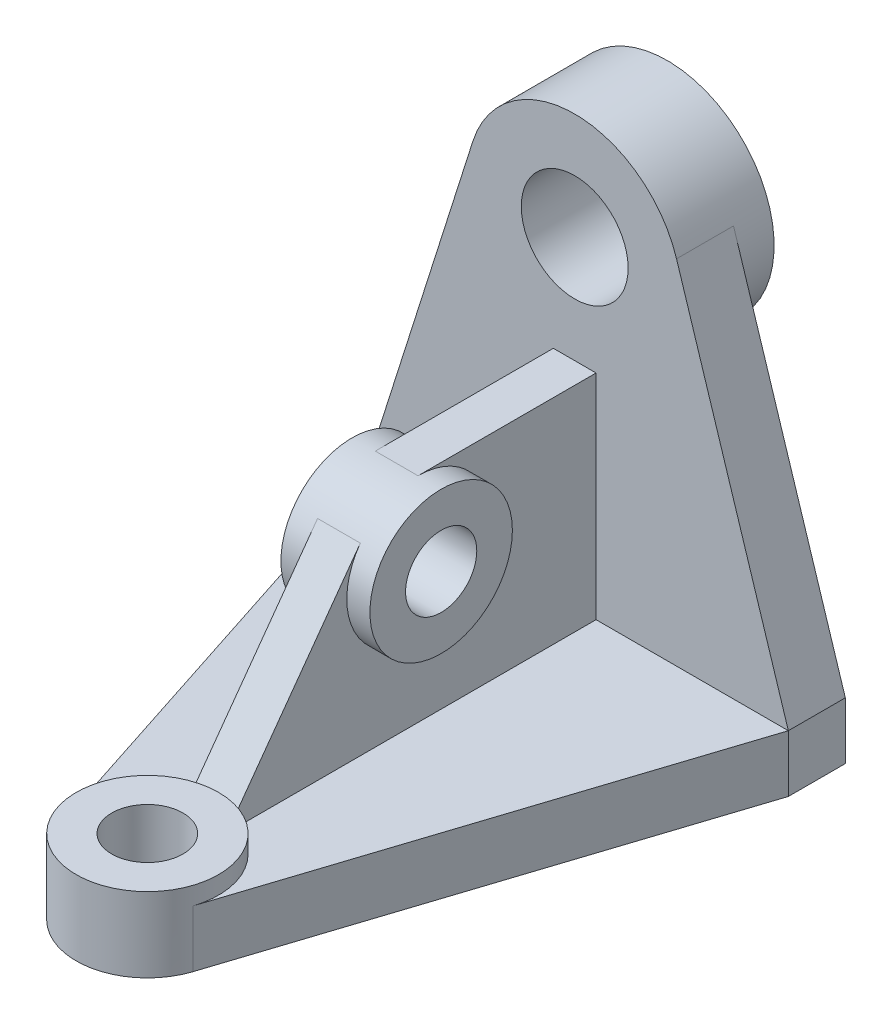
ISO-10303-21;
HEADER;
FILE_DESCRIPTION(('STEP AP214'),'2;1');
FILE_NAME('part.step','',(''),(''),'','','');
FILE_SCHEMA(('AUTOMOTIVE_DESIGN { 1 0 10303 214 1 1 1 1 }'));
ENDSEC;
DATA;
#1=APPLICATION_CONTEXT('core data for automotive mechanical design processes');
#2=APPLICATION_PROTOCOL_DEFINITION('international standard','automotive_design',2000,#1);
#3=PRODUCT_CONTEXT('',#1,'mechanical');
#4=PRODUCT('Part','Part','',(#3));
#5=PRODUCT_RELATED_PRODUCT_CATEGORY('part','',(#4));
#6=PRODUCT_DEFINITION_FORMATION('','',#4);
#7=PRODUCT_DEFINITION_CONTEXT('part definition',#1,'design');
#8=PRODUCT_DEFINITION('design','',#6,#7);
#9=PRODUCT_DEFINITION_SHAPE('','',#8);
#10=(LENGTH_UNIT() NAMED_UNIT(*) SI_UNIT(.MILLI.,.METRE.));
#11=(NAMED_UNIT(*) PLANE_ANGLE_UNIT() SI_UNIT($,.RADIAN.));
#12=(NAMED_UNIT(*) SI_UNIT($,.STERADIAN.) SOLID_ANGLE_UNIT());
#13=UNCERTAINTY_MEASURE_WITH_UNIT(LENGTH_MEASURE(1.E-05),#10,'distance_accuracy_value','');
#14=(GEOMETRIC_REPRESENTATION_CONTEXT(3) GLOBAL_UNCERTAINTY_ASSIGNED_CONTEXT((#13)) GLOBAL_UNIT_ASSIGNED_CONTEXT((#10,
#11,#12)) REPRESENTATION_CONTEXT('',''));
#15=CARTESIAN_POINT('',(0.,0.,0.));
#16=DIRECTION('',(0.,0.,1.));
#17=DIRECTION('',(1.,0.,0.));
#18=AXIS2_PLACEMENT_3D('',#15,#16,#17);
#19=CARTESIAN_POINT('',(0.,16.,136.));
#20=DIRECTION('',(0.,-1.,0.));
#21=DIRECTION('',(0.,0.,-1.));
#22=AXIS2_PLACEMENT_3D('',#19,#20,#21);
#23=PLANE('',#22);
#24=DIRECTION('',(0.,0.,1.));
#25=VECTOR('',#24,1.);
#26=CARTESIAN_POINT('',(-6.,16.,136.));
#27=LINE('',#26,#25);
#28=CARTESIAN_POINT('',(-6.,16.,16.));
#29=VERTEX_POINT('',#28);
#30=CARTESIAN_POINT('',(-6.,16.,116.921215971661));
#31=VERTEX_POINT('',#30);
#32=EDGE_CURVE('E51',#29,#31,#27,.T.);
#33=ORIENTED_EDGE('',*,*,#32,.F.);
#34=DIRECTION('',(1.,0.,0.));
#35=VECTOR('',#34,1.);
#36=CARTESIAN_POINT('',(-60.,16.,16.));
#37=LINE('',#36,#35);
#38=CARTESIAN_POINT('',(-60.,16.,16.));
#39=VERTEX_POINT('',#38);
#40=EDGE_CURVE('E227',#39,#29,#37,.T.);
#41=ORIENTED_EDGE('',*,*,#40,.F.);
#42=DIRECTION('',(-0.30888330538072,0.,-0.951099944094773));
#43=VECTOR('',#42,1.);
#44=CARTESIAN_POINT('',(-19.0219988818955,16.,142.177666107614));
#45=LINE('',#44,#43);
#46=CARTESIAN_POINT('',(-19.0219988818955,16.,142.177666107614));
#47=VERTEX_POINT('',#46);
#48=EDGE_CURVE('E223',#47,#39,#45,.T.);
#49=ORIENTED_EDGE('',*,*,#48,.F.);
#50=CARTESIAN_POINT('',(0.,16.,136.));
#51=DIRECTION('',(0.,1.,0.));
#52=DIRECTION('',(0.,0.,1.));
#53=AXIS2_PLACEMENT_3D('',#50,#51,#52);
#54=CIRCLE('',#53,20.);
#55=EDGE_CURVE('E204',#31,#47,#54,.T.);
#56=ORIENTED_EDGE('',*,*,#55,.F.);
#57=EDGE_LOOP('',(#33,#41,#49,#56));
#58=FACE_BOUND('',#57,.T.);
#59=ADVANCED_FACE('F36',(#58),#23,.F.);
#60=CARTESIAN_POINT('',(6.,16.,16.));
#61=VERTEX_POINT('',#60);
#62=CARTESIAN_POINT('',(60.,16.,16.));
#63=VERTEX_POINT('',#62);
#64=EDGE_CURVE('E89',#61,#63,#37,.T.);
#65=ORIENTED_EDGE('',*,*,#64,.F.);
#66=DIRECTION('',(0.,0.,1.));
#67=VECTOR('',#66,1.);
#68=CARTESIAN_POINT('',(6.,16.,136.));
#69=LINE('',#68,#67);
#70=CARTESIAN_POINT('',(6.,16.,116.921215971661));
#71=VERTEX_POINT('',#70);
#72=EDGE_CURVE('E196',#61,#71,#69,.T.);
#73=ORIENTED_EDGE('',*,*,#72,.T.);
#74=CARTESIAN_POINT('',(19.0219988818955,16.,142.177666107614));
#75=VERTEX_POINT('',#74);
#76=EDGE_CURVE('E209',#75,#71,#54,.T.);
#77=ORIENTED_EDGE('',*,*,#76,.F.);
#78=DIRECTION('',(-0.30888330538072,0.,0.951099944094773));
#79=VECTOR('',#78,1.);
#80=CARTESIAN_POINT('',(60.,16.,16.));
#81=LINE('',#80,#79);
#82=EDGE_CURVE('E230',#63,#75,#81,.T.);
#83=ORIENTED_EDGE('',*,*,#82,.F.);
#84=EDGE_LOOP('',(#65,#73,#77,#83));
#85=FACE_BOUND('',#84,.T.);
#86=ADVANCED_FACE('F339',(#85),#23,.F.);
#87=CARTESIAN_POINT('',(0.,106.,16.));
#88=DIRECTION('',(0.,0.,1.));
#89=DIRECTION('',(1.,0.,0.));
#90=AXIS2_PLACEMENT_3D('',#87,#88,#89);
#91=PLANE('',#90);
#92=DIRECTION('',(0.,1.,0.));
#93=VECTOR('',#92,1.);
#94=CARTESIAN_POINT('',(6.,106.,16.));
#95=LINE('',#94,#93);
#96=CARTESIAN_POINT('',(6.,76.,16.));
#97=VERTEX_POINT('',#96);
#98=EDGE_CURVE('E199',#61,#97,#95,.T.);
#99=ORIENTED_EDGE('',*,*,#98,.F.);
#100=ORIENTED_EDGE('',*,*,#64,.T.);
#101=DIRECTION('',(-0.302169479251962,0.953254218877943,0.));
#102=VECTOR('',#101,1.);
#103=CARTESIAN_POINT('',(60.,16.,16.));
#104=LINE('',#103,#102);
#105=CARTESIAN_POINT('',(28.5976265663383,115.065084377559,16.));
#106=VERTEX_POINT('',#105);
#107=EDGE_CURVE('E251',#63,#106,#104,.T.);
#108=ORIENTED_EDGE('',*,*,#107,.T.);
#109=CARTESIAN_POINT('',(0.,106.,16.));
#110=DIRECTION('',(0.,0.,1.));
#111=DIRECTION('',(1.,0.,0.));
#112=AXIS2_PLACEMENT_3D('',#109,#110,#111);
#113=CIRCLE('',#112,30.);
#114=CARTESIAN_POINT('',(-28.5976265663383,115.065084377559,16.));
#115=VERTEX_POINT('',#114);
#116=EDGE_CURVE('E60',#106,#115,#113,.T.);
#117=ORIENTED_EDGE('',*,*,#116,.T.);
#118=DIRECTION('',(-0.302169479251962,-0.953254218877943,0.));
#119=VECTOR('',#118,1.);
#120=CARTESIAN_POINT('',(-60.,16.,16.));
#121=LINE('',#120,#119);
#122=EDGE_CURVE('E254',#115,#39,#121,.T.);
#123=ORIENTED_EDGE('',*,*,#122,.T.);
#124=ORIENTED_EDGE('',*,*,#40,.T.);
#125=DIRECTION('',(0.,1.,0.));
#126=VECTOR('',#125,1.);
#127=CARTESIAN_POINT('',(-6.,106.,16.));
#128=LINE('',#127,#126);
#129=CARTESIAN_POINT('',(-6.,76.,16.));
#130=VERTEX_POINT('',#129);
#131=EDGE_CURVE('E192',#29,#130,#128,.T.);
#132=ORIENTED_EDGE('',*,*,#131,.T.);
#133=DIRECTION('',(1.,0.,0.));
#134=VECTOR('',#133,1.);
#135=CARTESIAN_POINT('',(0.,76.,16.));
#136=LINE('',#135,#134);
#137=EDGE_CURVE('E181',#97,#130,#136,.F.);
#138=ORIENTED_EDGE('',*,*,#137,.F.);
#139=EDGE_LOOP('',(#99,#100,#108,#117,#123,#124,#132,#138));
#140=FACE_BOUND('',#139,.T.);
#141=CARTESIAN_POINT('',(0.,106.,16.));
#142=DIRECTION('',(0.,0.,1.));
#143=DIRECTION('',(1.,0.,0.));
#144=AXIS2_PLACEMENT_3D('',#141,#142,#143);
#145=CIRCLE('',#144,15.);
#146=CARTESIAN_POINT('',(15.,106.,16.));
#147=VERTEX_POINT('',#146);
#148=EDGE_CURVE('E243',#147,#147,#145,.T.);
#149=ORIENTED_EDGE('',*,*,#148,.F.);
#150=EDGE_LOOP('',(#149));
#151=FACE_BOUND('',#150,.T.);
#152=ADVANCED_FACE('F301',(#140,#151),#91,.T.);
#153=CARTESIAN_POINT('',(0.,106.,0.));
#154=DIRECTION('',(0.,0.,1.));
#155=DIRECTION('',(1.,0.,0.));
#156=AXIS2_PLACEMENT_3D('',#153,#154,#155);
#157=PLANE('',#156);
#158=DIRECTION('',(-0.302169479251962,-0.953254218877943,0.));
#159=VECTOR('',#158,1.);
#160=CARTESIAN_POINT('',(-60.,16.,0.));
#161=LINE('',#160,#159);
#162=CARTESIAN_POINT('',(-28.5976265663383,115.065084377559,0.));
#163=VERTEX_POINT('',#162);
#164=CARTESIAN_POINT('',(-60.,16.,0.));
#165=VERTEX_POINT('',#164);
#166=EDGE_CURVE('E264',#163,#165,#161,.T.);
#167=ORIENTED_EDGE('',*,*,#166,.F.);
#168=CARTESIAN_POINT('',(0.,106.,0.));
#169=DIRECTION('',(0.,0.,-1.));
#170=DIRECTION('',(-1.,0.,0.));
#171=AXIS2_PLACEMENT_3D('',#168,#169,#170);
#172=CIRCLE('',#171,30.);
#173=CARTESIAN_POINT('',(28.5976265663383,115.065084377559,0.));
#174=VERTEX_POINT('',#173);
#175=EDGE_CURVE('E44',#174,#163,#172,.T.);
#176=ORIENTED_EDGE('',*,*,#175,.F.);
#177=DIRECTION('',(-0.302169479251962,0.953254218877943,0.));
#178=VECTOR('',#177,1.);
#179=CARTESIAN_POINT('',(60.,16.,0.));
#180=LINE('',#179,#178);
#181=CARTESIAN_POINT('',(60.,16.,0.));
#182=VERTEX_POINT('',#181);
#183=EDGE_CURVE('E261',#182,#174,#180,.T.);
#184=ORIENTED_EDGE('',*,*,#183,.F.);
#185=DIRECTION('',(0.,1.,0.));
#186=VECTOR('',#185,1.);
#187=CARTESIAN_POINT('',(60.,0.,0.));
#188=LINE('',#187,#186);
#189=CARTESIAN_POINT('',(60.,0.,0.));
#190=VERTEX_POINT('',#189);
#191=EDGE_CURVE('E247',#190,#182,#188,.T.);
#192=ORIENTED_EDGE('',*,*,#191,.F.);
#193=DIRECTION('',(1.,0.,0.));
#194=VECTOR('',#193,1.);
#195=CARTESIAN_POINT('',(-60.,0.,0.));
#196=LINE('',#195,#194);
#197=CARTESIAN_POINT('',(-60.,0.,0.));
#198=VERTEX_POINT('',#197);
#199=EDGE_CURVE('E84',#198,#190,#196,.T.);
#200=ORIENTED_EDGE('',*,*,#199,.F.);
#201=DIRECTION('',(0.,-1.,0.));
#202=VECTOR('',#201,1.);
#203=CARTESIAN_POINT('',(-60.,0.,0.));
#204=LINE('',#203,#202);
#205=EDGE_CURVE('E266',#165,#198,#204,.T.);
#206=ORIENTED_EDGE('',*,*,#205,.F.);
#207=EDGE_LOOP('',(#167,#176,#184,#192,#200,#206));
#208=FACE_BOUND('',#207,.T.);
#209=ADVANCED_FACE('F291',(#208),#157,.F.);
#210=CARTESIAN_POINT('',(60.,0.,16.));
#211=DIRECTION('',(-1.,0.,0.));
#212=DIRECTION('',(0.,0.,1.));
#213=AXIS2_PLACEMENT_3D('',#210,#211,#212);
#214=PLANE('',#213);
#215=ORIENTED_EDGE('',*,*,#191,.T.);
#216=DIRECTION('',(0.,0.,-1.));
#217=VECTOR('',#216,1.);
#218=CARTESIAN_POINT('',(60.,16.,16.));
#219=LINE('',#218,#217);
#220=EDGE_CURVE('E219',#63,#182,#219,.T.);
#221=ORIENTED_EDGE('',*,*,#220,.F.);
#222=DIRECTION('',(0.,1.,0.));
#223=VECTOR('',#222,1.);
#224=CARTESIAN_POINT('',(60.,0.,16.));
#225=LINE('',#224,#223);
#226=CARTESIAN_POINT('',(60.,0.,16.));
#227=VERTEX_POINT('',#226);
#228=EDGE_CURVE('E248',#227,#63,#225,.T.);
#229=ORIENTED_EDGE('',*,*,#228,.F.);
#230=DIRECTION('',(0.,0.,-1.));
#231=VECTOR('',#230,1.);
#232=CARTESIAN_POINT('',(60.,0.,16.));
#233=LINE('',#232,#231);
#234=EDGE_CURVE('E258',#227,#190,#233,.T.);
#235=ORIENTED_EDGE('',*,*,#234,.T.);
#236=EDGE_LOOP('',(#215,#221,#229,#235));
#237=FACE_BOUND('',#236,.T.);
#238=ADVANCED_FACE('F38',(#237),#214,.F.);
#239=CARTESIAN_POINT('',(60.,16.,16.));
#240=DIRECTION('',(-0.953254218877943,-0.302169479251962,0.));
#241=DIRECTION('',(0.302169479251962,-0.953254218877944,0.));
#242=AXIS2_PLACEMENT_3D('',#239,#240,#241);
#243=PLANE('',#242);
#244=ORIENTED_EDGE('',*,*,#183,.T.);
#245=DIRECTION('',(0.,0.,-1.));
#246=VECTOR('',#245,1.);
#247=CARTESIAN_POINT('',(28.5976265663383,115.065084377559,16.));
#248=LINE('',#247,#246);
#249=EDGE_CURVE('E278',#106,#174,#248,.T.);
#250=ORIENTED_EDGE('',*,*,#249,.F.);
#251=ORIENTED_EDGE('',*,*,#107,.F.);
#252=ORIENTED_EDGE('',*,*,#220,.T.);
#253=EDGE_LOOP('',(#244,#250,#251,#252));
#254=FACE_BOUND('',#253,.T.);
#255=ADVANCED_FACE('F284',(#254),#243,.F.);
#256=CARTESIAN_POINT('',(0.,106.,16.));
#257=DIRECTION('',(0.,0.,-1.));
#258=DIRECTION('',(-1.,0.,0.));
#259=AXIS2_PLACEMENT_3D('',#256,#257,#258);
#260=CYLINDRICAL_SURFACE('',#259,30.);
#261=ORIENTED_EDGE('',*,*,#175,.T.);
#262=DIRECTION('',(0.,0.,-1.));
#263=VECTOR('',#262,1.);
#264=CARTESIAN_POINT('',(-28.5976265663383,115.065084377559,16.));
#265=LINE('',#264,#263);
#266=EDGE_CURVE('E275',#115,#163,#265,.T.);
#267=ORIENTED_EDGE('',*,*,#266,.F.);
#268=ORIENTED_EDGE('',*,*,#116,.F.);
#269=ORIENTED_EDGE('',*,*,#249,.T.);
#270=EDGE_LOOP('',(#261,#267,#268,#269));
#271=FACE_BOUND('',#270,.T.);
#272=CARTESIAN_POINT('',(0.,106.,-10.));
#273=DIRECTION('',(0.,0.,-1.));
#274=DIRECTION('',(-1.,0.,0.));
#275=AXIS2_PLACEMENT_3D('',#272,#273,#274);
#276=CIRCLE('',#275,30.);
#277=CARTESIAN_POINT('',(-30.,106.,-10.));
#278=VERTEX_POINT('',#277);
#279=EDGE_CURVE('E214',#278,#278,#276,.T.);
#280=ORIENTED_EDGE('',*,*,#279,.F.);
#281=EDGE_LOOP('',(#280));
#282=FACE_BOUND('',#281,.T.);
#283=ADVANCED_FACE('F294',(#271,#282),#260,.T.);
#284=CARTESIAN_POINT('',(-60.,16.,16.));
#285=DIRECTION('',(0.953254218877943,-0.302169479251962,0.));
#286=DIRECTION('',(0.302169479251962,0.953254218877943,0.));
#287=AXIS2_PLACEMENT_3D('',#284,#285,#286);
#288=PLANE('',#287);
#289=ORIENTED_EDGE('',*,*,#166,.T.);
#290=DIRECTION('',(0.,0.,-1.));
#291=VECTOR('',#290,1.);
#292=CARTESIAN_POINT('',(-60.,16.,16.));
#293=LINE('',#292,#291);
#294=EDGE_CURVE('E272',#39,#165,#293,.T.);
#295=ORIENTED_EDGE('',*,*,#294,.F.);
#296=ORIENTED_EDGE('',*,*,#122,.F.);
#297=ORIENTED_EDGE('',*,*,#266,.T.);
#298=EDGE_LOOP('',(#289,#295,#296,#297));
#299=FACE_BOUND('',#298,.T.);
#300=ADVANCED_FACE('F299',(#299),#288,.F.);
#301=CARTESIAN_POINT('',(-60.,0.,16.));
#302=DIRECTION('',(1.,0.,0.));
#303=DIRECTION('',(0.,0.,-1.));
#304=AXIS2_PLACEMENT_3D('',#301,#302,#303);
#305=PLANE('',#304);
#306=ORIENTED_EDGE('',*,*,#205,.T.);
#307=DIRECTION('',(0.,0.,-1.));
#308=VECTOR('',#307,1.);
#309=CARTESIAN_POINT('',(-60.,0.,16.));
#310=LINE('',#309,#308);
#311=CARTESIAN_POINT('',(-60.,0.,16.));
#312=VERTEX_POINT('',#311);
#313=EDGE_CURVE('E270',#312,#198,#310,.T.);
#314=ORIENTED_EDGE('',*,*,#313,.F.);
#315=DIRECTION('',(0.,-1.,0.));
#316=VECTOR('',#315,1.);
#317=CARTESIAN_POINT('',(-60.,0.,16.));
#318=LINE('',#317,#316);
#319=EDGE_CURVE('E256',#39,#312,#318,.T.);
#320=ORIENTED_EDGE('',*,*,#319,.F.);
#321=ORIENTED_EDGE('',*,*,#294,.T.);
#322=EDGE_LOOP('',(#306,#314,#320,#321));
#323=FACE_BOUND('',#322,.T.);
#324=ADVANCED_FACE('F361',(#323),#305,.F.);
#325=CARTESIAN_POINT('',(-60.,0.,16.));
#326=DIRECTION('',(0.,1.,0.));
#327=DIRECTION('',(0.,0.,1.));
#328=AXIS2_PLACEMENT_3D('',#325,#326,#327);
#329=PLANE('',#328);
#330=ORIENTED_EDGE('',*,*,#199,.T.);
#331=ORIENTED_EDGE('',*,*,#234,.F.);
#332=DIRECTION('',(-0.30888330538072,0.,0.951099944094773));
#333=VECTOR('',#332,1.);
#334=CARTESIAN_POINT('',(60.,0.,16.));
#335=LINE('',#334,#333);
#336=CARTESIAN_POINT('',(19.0219988818955,0.,142.177666107614));
#337=VERTEX_POINT('',#336);
#338=EDGE_CURVE('E226',#227,#337,#335,.T.);
#339=ORIENTED_EDGE('',*,*,#338,.T.);
#340=CARTESIAN_POINT('',(0.,0.,136.));
#341=DIRECTION('',(0.,-1.,0.));
#342=DIRECTION('',(0.,0.,-1.));
#343=AXIS2_PLACEMENT_3D('',#340,#341,#342);
#344=CIRCLE('',#343,20.);
#345=CARTESIAN_POINT('',(-19.0219988818955,0.,142.177666107614));
#346=VERTEX_POINT('',#345);
#347=EDGE_CURVE('E222',#337,#346,#344,.T.);
#348=ORIENTED_EDGE('',*,*,#347,.T.);
#349=DIRECTION('',(-0.30888330538072,0.,-0.951099944094773));
#350=VECTOR('',#349,1.);
#351=CARTESIAN_POINT('',(-19.0219988818955,0.,142.177666107614));
#352=LINE('',#351,#350);
#353=EDGE_CURVE('E236',#346,#312,#352,.T.);
#354=ORIENTED_EDGE('',*,*,#353,.T.);
#355=ORIENTED_EDGE('',*,*,#313,.T.);
#356=EDGE_LOOP('',(#330,#331,#339,#348,#354,#355));
#357=FACE_BOUND('',#356,.T.);
#358=CARTESIAN_POINT('',(0.,0.,136.));
#359=DIRECTION('',(0.,-1.,0.));
#360=DIRECTION('',(0.,0.,-1.));
#361=AXIS2_PLACEMENT_3D('',#358,#359,#360);
#362=CIRCLE('',#361,10.);
#363=CARTESIAN_POINT('',(0.,0.,126.));
#364=VERTEX_POINT('',#363);
#365=EDGE_CURVE('E217',#364,#364,#362,.T.);
#366=ORIENTED_EDGE('',*,*,#365,.F.);
#367=EDGE_LOOP('',(#366));
#368=FACE_BOUND('',#367,.T.);
#369=ADVANCED_FACE('F353',(#357,#368),#329,.F.);
#370=CARTESIAN_POINT('',(0.,106.,16.));
#371=DIRECTION('',(0.,0.,-1.));
#372=DIRECTION('',(-1.,0.,0.));
#373=AXIS2_PLACEMENT_3D('',#370,#371,#372);
#374=CYLINDRICAL_SURFACE('',#373,15.);
#375=ORIENTED_EDGE('',*,*,#148,.T.);
#376=EDGE_LOOP('',(#375));
#377=FACE_BOUND('',#376,.T.);
#378=CARTESIAN_POINT('',(0.,106.,-10.));
#379=DIRECTION('',(0.,0.,-1.));
#380=DIRECTION('',(-1.,0.,0.));
#381=AXIS2_PLACEMENT_3D('',#378,#379,#380);
#382=CIRCLE('',#381,15.);
#383=CARTESIAN_POINT('',(-15.,106.,-10.));
#384=VERTEX_POINT('',#383);
#385=EDGE_CURVE('E208',#384,#384,#382,.T.);
#386=ORIENTED_EDGE('',*,*,#385,.T.);
#387=EDGE_LOOP('',(#386));
#388=FACE_BOUND('',#387,.T.);
#389=ADVANCED_FACE('F350',(#377,#388),#374,.F.);
#390=CARTESIAN_POINT('',(0.,16.,136.));
#391=DIRECTION('',(0.,-1.,0.));
#392=DIRECTION('',(0.,0.,-1.));
#393=AXIS2_PLACEMENT_3D('',#390,#391,#392);
#394=CYLINDRICAL_SURFACE('',#393,20.);
#395=DIRECTION('',(0.,-1.,0.));
#396=VECTOR('',#395,1.);
#397=CARTESIAN_POINT('',(6.,16.,116.921215971661));
#398=LINE('',#397,#396);
#399=CARTESIAN_POINT('',(6.,19.7264161733114,116.921215971661));
#400=VERTEX_POINT('',#399);
#401=EDGE_CURVE('E194',#400,#71,#398,.T.);
#402=ORIENTED_EDGE('',*,*,#401,.F.);
#403=CARTESIAN_POINT('',(0.,-6.65005961397224,136.));
#404=DIRECTION('',(0.,-0.586078026487973,-0.810254618541581));
#405=DIRECTION('',(0.,-0.810254618541581,0.586078026487972));
#406=AXIS2_PLACEMENT_3D('',#403,#404,#405);
#407=ELLIPSE('',#406,34.1251490349305,20.);
#408=CARTESIAN_POINT('',(0.,21.,116.));
#409=VERTEX_POINT('',#408);
#410=EDGE_CURVE('E160',#409,#400,#407,.T.);
#411=ORIENTED_EDGE('',*,*,#410,.F.);
#412=CARTESIAN_POINT('',(0.,21.,136.));
#413=DIRECTION('',(0.,1.,0.));
#414=DIRECTION('',(0.,0.,1.));
#415=AXIS2_PLACEMENT_3D('',#412,#413,#414);
#416=CIRCLE('',#415,20.);
#417=EDGE_CURVE('E205',#409,#409,#416,.T.);
#418=ORIENTED_EDGE('',*,*,#417,.F.);
#419=CARTESIAN_POINT('',(-6.,19.7264161733114,116.921215971661));
#420=VERTEX_POINT('',#419);
#421=EDGE_CURVE('E188',#420,#409,#407,.T.);
#422=ORIENTED_EDGE('',*,*,#421,.F.);
#423=DIRECTION('',(0.,-1.,0.));
#424=VECTOR('',#423,1.);
#425=CARTESIAN_POINT('',(-6.,16.,116.921215971661));
#426=LINE('',#425,#424);
#427=EDGE_CURVE('E166',#420,#31,#426,.T.);
#428=ORIENTED_EDGE('',*,*,#427,.T.);
#429=ORIENTED_EDGE('',*,*,#55,.T.);
#430=DIRECTION('',(0.,-1.,0.));
#431=VECTOR('',#430,1.);
#432=CARTESIAN_POINT('',(-19.0219988818955,16.,142.177666107614));
#433=LINE('',#432,#431);
#434=EDGE_CURVE('E233',#47,#346,#433,.T.);
#435=ORIENTED_EDGE('',*,*,#434,.T.);
#436=ORIENTED_EDGE('',*,*,#347,.F.);
#437=DIRECTION('',(0.,-1.,0.));
#438=VECTOR('',#437,1.);
#439=CARTESIAN_POINT('',(19.0219988818955,16.,142.177666107614));
#440=LINE('',#439,#438);
#441=EDGE_CURVE('E241',#75,#337,#440,.T.);
#442=ORIENTED_EDGE('',*,*,#441,.F.);
#443=ORIENTED_EDGE('',*,*,#76,.T.);
#444=EDGE_LOOP('',(#402,#411,#418,#422,#428,#429,#435,#436,#442,#443));
#445=FACE_BOUND('',#444,.T.);
#446=ADVANCED_FACE('F313',(#445),#394,.T.);
#447=CARTESIAN_POINT('',(60.,16.,16.));
#448=DIRECTION('',(0.951099944094773,0.,0.30888330538072));
#449=DIRECTION('',(0.30888330538072,0.,-0.951099944094773));
#450=AXIS2_PLACEMENT_3D('',#447,#448,#449);
#451=PLANE('',#450);
#452=ORIENTED_EDGE('',*,*,#338,.F.);
#453=ORIENTED_EDGE('',*,*,#228,.T.);
#454=ORIENTED_EDGE('',*,*,#82,.T.);
#455=ORIENTED_EDGE('',*,*,#441,.T.);
#456=EDGE_LOOP('',(#452,#453,#454,#455));
#457=FACE_BOUND('',#456,.T.);
#458=ADVANCED_FACE('F335',(#457),#451,.T.);
#459=CARTESIAN_POINT('',(-19.0219988818955,16.,142.177666107614));
#460=DIRECTION('',(-0.951099944094773,0.,0.30888330538072));
#461=DIRECTION('',(0.30888330538072,0.,0.951099944094773));
#462=AXIS2_PLACEMENT_3D('',#459,#460,#461);
#463=PLANE('',#462);
#464=ORIENTED_EDGE('',*,*,#353,.F.);
#465=ORIENTED_EDGE('',*,*,#434,.F.);
#466=ORIENTED_EDGE('',*,*,#48,.T.);
#467=ORIENTED_EDGE('',*,*,#319,.T.);
#468=EDGE_LOOP('',(#464,#465,#466,#467));
#469=FACE_BOUND('',#468,.T.);
#470=ADVANCED_FACE('F309',(#469),#463,.T.);
#471=CARTESIAN_POINT('',(0.,16.,136.));
#472=DIRECTION('',(0.,-1.,0.));
#473=DIRECTION('',(0.,0.,-1.));
#474=AXIS2_PLACEMENT_3D('',#471,#472,#473);
#475=CYLINDRICAL_SURFACE('',#474,10.);
#476=ORIENTED_EDGE('',*,*,#365,.T.);
#477=EDGE_LOOP('',(#476));
#478=FACE_BOUND('',#477,.T.);
#479=CARTESIAN_POINT('',(0.,21.,136.));
#480=DIRECTION('',(0.,1.,0.));
#481=DIRECTION('',(0.,0.,1.));
#482=AXIS2_PLACEMENT_3D('',#479,#480,#481);
#483=CIRCLE('',#482,10.);
#484=CARTESIAN_POINT('',(0.,21.,146.));
#485=VERTEX_POINT('',#484);
#486=EDGE_CURVE('E201',#485,#485,#483,.T.);
#487=ORIENTED_EDGE('',*,*,#486,.T.);
#488=EDGE_LOOP('',(#487));
#489=FACE_BOUND('',#488,.T.);
#490=ADVANCED_FACE('F325',(#478,#489),#475,.F.);
#491=CARTESIAN_POINT('',(0.,106.,-10.));
#492=DIRECTION('',(0.,0.,-1.));
#493=DIRECTION('',(-1.,0.,0.));
#494=AXIS2_PLACEMENT_3D('',#491,#492,#493);
#495=PLANE('',#494);
#496=ORIENTED_EDGE('',*,*,#279,.T.);
#497=EDGE_LOOP('',(#496));
#498=FACE_BOUND('',#497,.T.);
#499=ORIENTED_EDGE('',*,*,#385,.F.);
#500=EDGE_LOOP('',(#499));
#501=FACE_BOUND('',#500,.T.);
#502=ADVANCED_FACE('F321',(#498,#501),#495,.T.);
#503=CARTESIAN_POINT('',(0.,21.,136.));
#504=DIRECTION('',(0.,1.,0.));
#505=DIRECTION('',(0.,0.,1.));
#506=AXIS2_PLACEMENT_3D('',#503,#504,#505);
#507=PLANE('',#506);
#508=ORIENTED_EDGE('',*,*,#417,.T.);
#509=EDGE_LOOP('',(#508));
#510=FACE_BOUND('',#509,.T.);
#511=ORIENTED_EDGE('',*,*,#486,.F.);
#512=EDGE_LOOP('',(#511));
#513=FACE_BOUND('',#512,.T.);
#514=ADVANCED_FACE('F318',(#510,#513),#507,.T.);
#515=CARTESIAN_POINT('',(0.,21.,116.));
#516=DIRECTION('',(0.,-0.586078026487973,-0.810254618541581));
#517=DIRECTION('',(0.,0.810254618541581,-0.586078026487972));
#518=AXIS2_PLACEMENT_3D('',#515,#516,#517);
#519=PLANE('',#518);
#520=DIRECTION('',(0.,0.810254618541581,-0.586078026487972));
#521=VECTOR('',#520,1.);
#522=CARTESIAN_POINT('',(-6.,21.,116.));
#523=LINE('',#522,#521);
#524=CARTESIAN_POINT('',(-6.,67.7215605297594,82.2050923708317));
#525=VERTEX_POINT('',#524);
#526=EDGE_CURVE('E155',#420,#525,#523,.T.);
#527=ORIENTED_EDGE('',*,*,#526,.F.);
#528=ORIENTED_EDGE('',*,*,#421,.T.);
#529=ORIENTED_EDGE('',*,*,#410,.T.);
#530=DIRECTION('',(0.,0.810254618541581,-0.586078026487972));
#531=VECTOR('',#530,1.);
#532=CARTESIAN_POINT('',(6.,21.,116.));
#533=LINE('',#532,#531);
#534=CARTESIAN_POINT('',(6.,67.7215605297594,82.2050923708316));
#535=VERTEX_POINT('',#534);
#536=EDGE_CURVE('E158',#400,#535,#533,.T.);
#537=ORIENTED_EDGE('',*,*,#536,.T.);
#538=DIRECTION('',(1.,0.,0.));
#539=VECTOR('',#538,1.);
#540=CARTESIAN_POINT('',(0.,67.7215605297594,82.2050923708316));
#541=LINE('',#540,#539);
#542=EDGE_CURVE('E152',#525,#535,#541,.T.);
#543=ORIENTED_EDGE('',*,*,#542,.F.);
#544=EDGE_LOOP('',(#527,#528,#529,#537,#543));
#545=FACE_BOUND('',#544,.T.);
#546=ADVANCED_FACE('F154',(#545),#519,.F.);
#547=CARTESIAN_POINT('',(0.,76.,16.));
#548=DIRECTION('',(0.,-1.,0.));
#549=DIRECTION('',(0.,0.,-1.));
#550=AXIS2_PLACEMENT_3D('',#547,#548,#549);
#551=PLANE('',#550);
#552=DIRECTION('',(0.,0.,-1.));
#553=VECTOR('',#552,1.);
#554=CARTESIAN_POINT('',(6.,76.,73.));
#555=LINE('',#554,#553);
#556=CARTESIAN_POINT('',(6.,76.,66.));
#557=VERTEX_POINT('',#556);
#558=EDGE_CURVE('E177',#557,#97,#555,.T.);
#559=ORIENTED_EDGE('',*,*,#558,.T.);
#560=ORIENTED_EDGE('',*,*,#137,.T.);
#561=DIRECTION('',(0.,0.,-1.));
#562=VECTOR('',#561,1.);
#563=CARTESIAN_POINT('',(-6.,76.,73.));
#564=LINE('',#563,#562);
#565=CARTESIAN_POINT('',(-6.,76.,66.));
#566=VERTEX_POINT('',#565);
#567=EDGE_CURVE('E167',#566,#130,#564,.T.);
#568=ORIENTED_EDGE('',*,*,#567,.F.);
#569=DIRECTION('',(1.,0.,0.));
#570=VECTOR('',#569,1.);
#571=CARTESIAN_POINT('',(0.,76.,66.));
#572=LINE('',#571,#570);
#573=EDGE_CURVE('E161',#566,#557,#572,.T.);
#574=ORIENTED_EDGE('',*,*,#573,.T.);
#575=EDGE_LOOP('',(#559,#560,#568,#574));
#576=FACE_BOUND('',#575,.T.);
#577=ADVANCED_FACE('F179',(#576),#551,.F.);
#578=CARTESIAN_POINT('',(0.,56.,66.));
#579=DIRECTION('',(-1.,0.,0.));
#580=DIRECTION('',(0.,0.,1.));
#581=AXIS2_PLACEMENT_3D('',#578,#579,#580);
#582=CYLINDRICAL_SURFACE('',#581,20.);
#583=ORIENTED_EDGE('',*,*,#573,.F.);
#584=CARTESIAN_POINT('',(-6.,56.,66.));
#585=DIRECTION('',(1.,0.,0.));
#586=DIRECTION('',(0.,0.,-1.));
#587=AXIS2_PLACEMENT_3D('',#584,#585,#586);
#588=CIRCLE('',#587,20.);
#589=EDGE_CURVE('E11',#566,#525,#588,.F.);
#590=ORIENTED_EDGE('',*,*,#589,.T.);
#591=ORIENTED_EDGE('',*,*,#542,.T.);
#592=CARTESIAN_POINT('',(6.,56.,66.));
#593=DIRECTION('',(1.,0.,0.));
#594=DIRECTION('',(0.,0.,-1.));
#595=AXIS2_PLACEMENT_3D('',#592,#593,#594);
#596=CIRCLE('',#595,20.);
#597=EDGE_CURVE('E168',#557,#535,#596,.F.);
#598=ORIENTED_EDGE('',*,*,#597,.F.);
#599=EDGE_LOOP('',(#583,#590,#591,#598));
#600=FACE_BOUND('',#599,.T.);
#601=CARTESIAN_POINT('',(-12.5,56.,66.));
#602=DIRECTION('',(1.,0.,0.));
#603=DIRECTION('',(0.,0.,-1.));
#604=AXIS2_PLACEMENT_3D('',#601,#602,#603);
#605=CIRCLE('',#604,20.);
#606=CARTESIAN_POINT('',(-12.5,56.,46.));
#607=VERTEX_POINT('',#606);
#608=EDGE_CURVE('E547',#607,#607,#605,.T.);
#609=ORIENTED_EDGE('',*,*,#608,.T.);
#610=EDGE_LOOP('',(#609));
#611=FACE_BOUND('',#610,.T.);
#612=CARTESIAN_POINT('',(12.5,56.,66.));
#613=DIRECTION('',(1.,0.,0.));
#614=DIRECTION('',(0.,0.,-1.));
#615=AXIS2_PLACEMENT_3D('',#612,#613,#614);
#616=CIRCLE('',#615,20.);
#617=CARTESIAN_POINT('',(12.5,56.,46.));
#618=VERTEX_POINT('',#617);
#619=EDGE_CURVE('E550',#618,#618,#616,.T.);
#620=ORIENTED_EDGE('',*,*,#619,.F.);
#621=EDGE_LOOP('',(#620));
#622=FACE_BOUND('',#621,.T.);
#623=ADVANCED_FACE('F170',(#600,#611,#622),#582,.T.);
#624=CARTESIAN_POINT('',(6.,68.,73.));
#625=DIRECTION('',(1.,0.,0.));
#626=DIRECTION('',(0.,0.,-1.));
#627=AXIS2_PLACEMENT_3D('',#624,#625,#626);
#628=PLANE('',#627);
#629=ORIENTED_EDGE('',*,*,#558,.F.);
#630=ORIENTED_EDGE('',*,*,#597,.T.);
#631=ORIENTED_EDGE('',*,*,#536,.F.);
#632=ORIENTED_EDGE('',*,*,#401,.T.);
#633=ORIENTED_EDGE('',*,*,#72,.F.);
#634=ORIENTED_EDGE('',*,*,#98,.T.);
#635=EDGE_LOOP('',(#629,#630,#631,#632,#633,#634));
#636=FACE_BOUND('',#635,.T.);
#637=ADVANCED_FACE('F489',(#636),#628,.T.);
#638=CARTESIAN_POINT('',(-6.,68.,73.));
#639=DIRECTION('',(1.,0.,0.));
#640=DIRECTION('',(0.,0.,-1.));
#641=AXIS2_PLACEMENT_3D('',#638,#639,#640);
#642=PLANE('',#641);
#643=ORIENTED_EDGE('',*,*,#589,.F.);
#644=ORIENTED_EDGE('',*,*,#567,.T.);
#645=ORIENTED_EDGE('',*,*,#131,.F.);
#646=ORIENTED_EDGE('',*,*,#32,.T.);
#647=ORIENTED_EDGE('',*,*,#427,.F.);
#648=ORIENTED_EDGE('',*,*,#526,.T.);
#649=EDGE_LOOP('',(#643,#644,#645,#646,#647,#648));
#650=FACE_BOUND('',#649,.T.);
#651=ADVANCED_FACE('F163',(#650),#642,.F.);
#652=CARTESIAN_POINT('',(-12.5,56.,66.));
#653=DIRECTION('',(1.,0.,0.));
#654=DIRECTION('',(0.,0.,-1.));
#655=AXIS2_PLACEMENT_3D('',#652,#653,#654);
#656=PLANE('',#655);
#657=CARTESIAN_POINT('',(-12.5,56.,66.));
#658=DIRECTION('',(1.,0.,0.));
#659=DIRECTION('',(0.,0.,-1.));
#660=AXIS2_PLACEMENT_3D('',#657,#658,#659);
#661=CIRCLE('',#660,10.);
#662=CARTESIAN_POINT('',(-12.5,56.,56.));
#663=VERTEX_POINT('',#662);
#664=EDGE_CURVE('E546',#663,#663,#661,.T.);
#665=ORIENTED_EDGE('',*,*,#664,.T.);
#666=EDGE_LOOP('',(#665));
#667=FACE_BOUND('',#666,.T.);
#668=ORIENTED_EDGE('',*,*,#608,.F.);
#669=EDGE_LOOP('',(#668));
#670=FACE_BOUND('',#669,.T.);
#671=ADVANCED_FACE('F508',(#667,#670),#656,.F.);
#672=CARTESIAN_POINT('',(12.5,56.,66.));
#673=DIRECTION('',(1.,0.,0.));
#674=DIRECTION('',(0.,0.,-1.));
#675=AXIS2_PLACEMENT_3D('',#672,#673,#674);
#676=PLANE('',#675);
#677=CARTESIAN_POINT('',(12.5,56.,66.));
#678=DIRECTION('',(1.,0.,0.));
#679=DIRECTION('',(0.,0.,-1.));
#680=AXIS2_PLACEMENT_3D('',#677,#678,#679);
#681=CIRCLE('',#680,10.);
#682=CARTESIAN_POINT('',(12.5,56.,56.));
#683=VERTEX_POINT('',#682);
#684=EDGE_CURVE('E543',#683,#683,#681,.T.);
#685=ORIENTED_EDGE('',*,*,#684,.F.);
#686=EDGE_LOOP('',(#685));
#687=FACE_BOUND('',#686,.T.);
#688=ORIENTED_EDGE('',*,*,#619,.T.);
#689=EDGE_LOOP('',(#688));
#690=FACE_BOUND('',#689,.T.);
#691=ADVANCED_FACE('F516',(#687,#690),#676,.T.);
#692=CARTESIAN_POINT('',(-60.,56.,66.));
#693=DIRECTION('',(1.,0.,0.));
#694=DIRECTION('',(0.,0.,-1.));
#695=AXIS2_PLACEMENT_3D('',#692,#693,#694);
#696=CYLINDRICAL_SURFACE('',#695,10.);
#697=ORIENTED_EDGE('',*,*,#684,.T.);
#698=EDGE_LOOP('',(#697));
#699=FACE_BOUND('',#698,.T.);
#700=ORIENTED_EDGE('',*,*,#664,.F.);
#701=EDGE_LOOP('',(#700));
#702=FACE_BOUND('',#701,.T.);
#703=ADVANCED_FACE('F526',(#699,#702),#696,.F.);
#704=CLOSED_SHELL('',(#59,#86,#152,#209,#238,#255,#283,#300,#324,#369,#389,#446,#458,#470,#490,
#502,#514,#546,#577,#623,#637,#651,#671,#691,#703));
#705=MANIFOLD_SOLID_BREP('B2',#704);
#706=ADVANCED_BREP_SHAPE_REPRESENTATION('',(#18,#705),#14);
#707=SHAPE_DEFINITION_REPRESENTATION(#9,#706);
ENDSEC;
END-ISO-10303-21;
